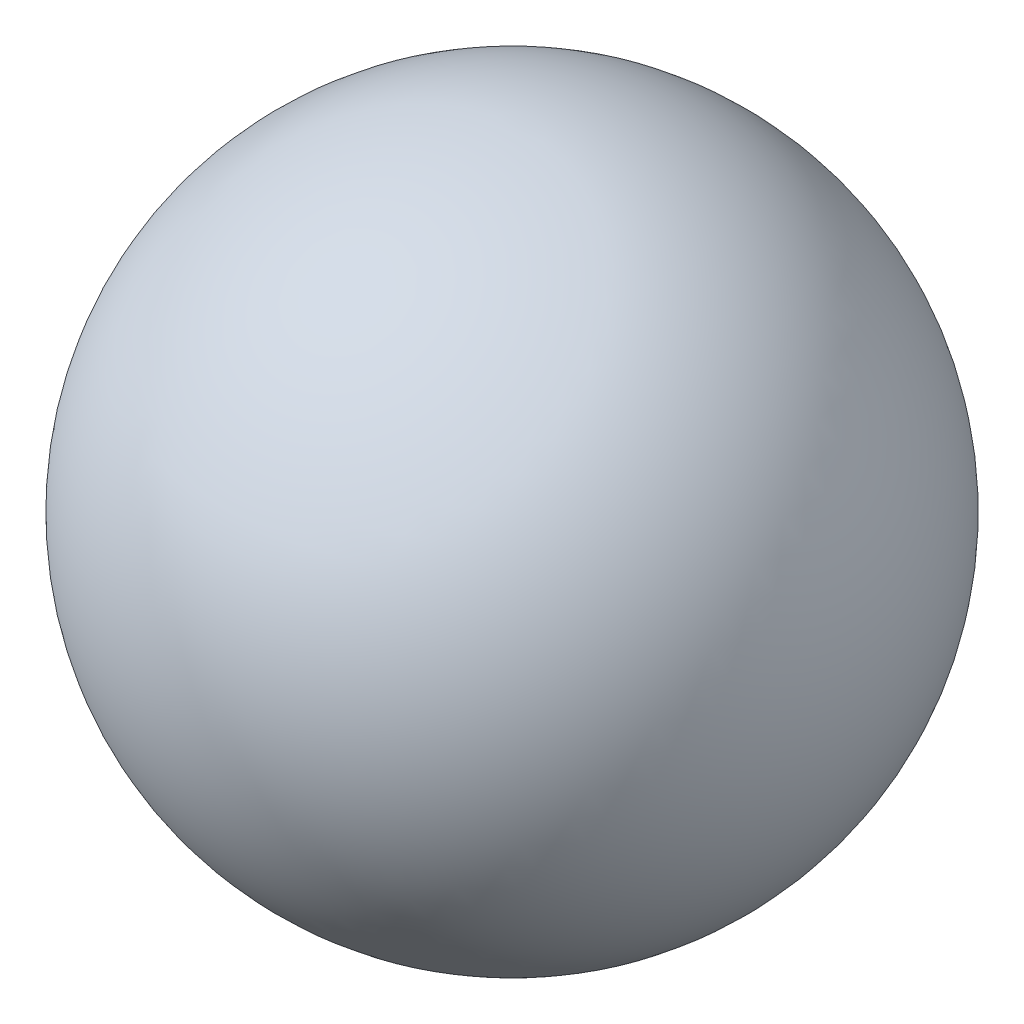
ISO-10303-21;
HEADER;
FILE_DESCRIPTION(('STEP AP214'),'2;1');
FILE_NAME('part.step','',(''),(''),'','','');
FILE_SCHEMA(('AUTOMOTIVE_DESIGN { 1 0 10303 214 1 1 1 1 }'));
ENDSEC;
DATA;
#1=APPLICATION_CONTEXT('core data for automotive mechanical design processes');
#2=APPLICATION_PROTOCOL_DEFINITION('international standard','automotive_design',2000,#1);
#3=PRODUCT_CONTEXT('',#1,'mechanical');
#4=PRODUCT('Part','Part','',(#3));
#5=PRODUCT_RELATED_PRODUCT_CATEGORY('part','',(#4));
#6=PRODUCT_DEFINITION_FORMATION('','',#4);
#7=PRODUCT_DEFINITION_CONTEXT('part definition',#1,'design');
#8=PRODUCT_DEFINITION('design','',#6,#7);
#9=PRODUCT_DEFINITION_SHAPE('','',#8);
#10=(LENGTH_UNIT() NAMED_UNIT(*) SI_UNIT(.MILLI.,.METRE.));
#11=(NAMED_UNIT(*) PLANE_ANGLE_UNIT() SI_UNIT($,.RADIAN.));
#12=(NAMED_UNIT(*) SI_UNIT($,.STERADIAN.) SOLID_ANGLE_UNIT());
#13=UNCERTAINTY_MEASURE_WITH_UNIT(LENGTH_MEASURE(1.E-05),#10,'distance_accuracy_value','');
#14=(GEOMETRIC_REPRESENTATION_CONTEXT(3) GLOBAL_UNCERTAINTY_ASSIGNED_CONTEXT((#13)) GLOBAL_UNIT_ASSIGNED_CONTEXT((#10,
#11,#12)) REPRESENTATION_CONTEXT('',''));
#15=CARTESIAN_POINT('',(0.,0.,0.));
#16=DIRECTION('',(0.,0.,1.));
#17=DIRECTION('',(1.,0.,0.));
#18=AXIS2_PLACEMENT_3D('',#15,#16,#17);
#19=CARTESIAN_POINT('',(0.,0.,0.));
#20=DIRECTION('',(0.,1.,0.));
#21=DIRECTION('',(1.,0.,0.));
#22=AXIS2_PLACEMENT_3D('',#19,#20,#21);
#23=SPHERICAL_SURFACE('',#22,9.525);
#24=CARTESIAN_POINT('',(0.,9.525,0.));
#25=VERTEX_POINT('',#24);
#26=VERTEX_LOOP('',#25);
#27=FACE_BOUND('',#26,.T.);
#28=ADVANCED_FACE('F31',(#27),#23,.T.);
#29=CLOSED_SHELL('',(#28));
#30=MANIFOLD_SOLID_BREP('B2',#29);
#31=ADVANCED_BREP_SHAPE_REPRESENTATION('',(#18,#30),#14);
#32=SHAPE_DEFINITION_REPRESENTATION(#9,#31);
ENDSEC;
END-ISO-10303-21;
